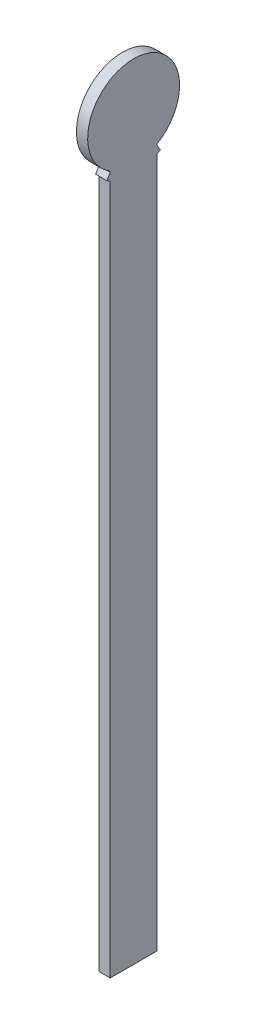
ISO-10303-21;
HEADER;
FILE_DESCRIPTION(('STEP AP214'),'2;1');
FILE_NAME('part.step','',(''),(''),'','','');
FILE_SCHEMA(('AUTOMOTIVE_DESIGN { 1 0 10303 214 1 1 1 1 }'));
ENDSEC;
DATA;
#1=APPLICATION_CONTEXT('core data for automotive mechanical design processes');
#2=APPLICATION_PROTOCOL_DEFINITION('international standard','automotive_design',2000,#1);
#3=PRODUCT_CONTEXT('',#1,'mechanical');
#4=PRODUCT('Part','Part','',(#3));
#5=PRODUCT_RELATED_PRODUCT_CATEGORY('part','',(#4));
#6=PRODUCT_DEFINITION_FORMATION('','',#4);
#7=PRODUCT_DEFINITION_CONTEXT('part definition',#1,'design');
#8=PRODUCT_DEFINITION('design','',#6,#7);
#9=PRODUCT_DEFINITION_SHAPE('','',#8);
#10=(LENGTH_UNIT() NAMED_UNIT(*) SI_UNIT(.MILLI.,.METRE.));
#11=(NAMED_UNIT(*) PLANE_ANGLE_UNIT() SI_UNIT($,.RADIAN.));
#12=(NAMED_UNIT(*) SI_UNIT($,.STERADIAN.) SOLID_ANGLE_UNIT());
#13=UNCERTAINTY_MEASURE_WITH_UNIT(LENGTH_MEASURE(1.E-05),#10,'distance_accuracy_value','');
#14=(GEOMETRIC_REPRESENTATION_CONTEXT(3) GLOBAL_UNCERTAINTY_ASSIGNED_CONTEXT((#13)) GLOBAL_UNIT_ASSIGNED_CONTEXT((#10,
#11,#12)) REPRESENTATION_CONTEXT('',''));
#15=CARTESIAN_POINT('',(0.,0.,0.));
#16=DIRECTION('',(0.,0.,1.));
#17=DIRECTION('',(1.,0.,0.));
#18=AXIS2_PLACEMENT_3D('',#15,#16,#17);
#19=CARTESIAN_POINT('',(3.,196.8,0.));
#20=DIRECTION('',(-1.,0.,0.));
#21=DIRECTION('',(0.,0.,1.));
#22=AXIS2_PLACEMENT_3D('',#19,#20,#21);
#23=CYLINDRICAL_SURFACE('',#22,24.5);
#24=CARTESIAN_POINT('',(-3.,196.8,0.));
#25=DIRECTION('',(1.,0.,0.));
#26=DIRECTION('',(0.,0.,-1.));
#27=AXIS2_PLACEMENT_3D('',#24,#25,#26);
#28=CIRCLE('',#27,24.5);
#29=CARTESIAN_POINT('',(-3.,175.728692494294,-12.4999999999994));
#30=VERTEX_POINT('',#29);
#31=CARTESIAN_POINT('',(-3.,175.728692494295,12.5000000000002));
#32=VERTEX_POINT('',#31);
#33=EDGE_CURVE('E148',#30,#32,#28,.T.);
#34=ORIENTED_EDGE('',*,*,#33,.T.);
#35=DIRECTION('',(-1.,0.,0.));
#36=VECTOR('',#35,1.);
#37=CARTESIAN_POINT('',(3.,175.728692494295,12.5000000000002));
#38=LINE('',#37,#36);
#39=CARTESIAN_POINT('',(3.,175.728692494295,12.5000000000002));
#40=VERTEX_POINT('',#39);
#41=EDGE_CURVE('E11',#40,#32,#38,.T.);
#42=ORIENTED_EDGE('',*,*,#41,.F.);
#43=CARTESIAN_POINT('',(3.,196.8,0.));
#44=DIRECTION('',(1.,0.,0.));
#45=DIRECTION('',(0.,0.,-1.));
#46=AXIS2_PLACEMENT_3D('',#43,#44,#45);
#47=CIRCLE('',#46,24.5);
#48=CARTESIAN_POINT('',(3.,175.728692494294,-12.4999999999994));
#49=VERTEX_POINT('',#48);
#50=EDGE_CURVE('E168',#49,#40,#47,.T.);
#51=ORIENTED_EDGE('',*,*,#50,.F.);
#52=DIRECTION('',(-1.,0.,0.));
#53=VECTOR('',#52,1.);
#54=CARTESIAN_POINT('',(3.,175.728692494294,-12.4999999999994));
#55=LINE('',#54,#53);
#56=EDGE_CURVE('E55',#49,#30,#55,.T.);
#57=ORIENTED_EDGE('',*,*,#56,.T.);
#58=EDGE_LOOP('',(#34,#42,#51,#57));
#59=FACE_BOUND('',#58,.T.);
#60=ADVANCED_FACE('F39',(#59),#23,.T.);
#61=CARTESIAN_POINT('',(3.,5.06683815275196E-13,12.5000000000074));
#62=DIRECTION('',(0.,0.,-1.));
#63=DIRECTION('',(0.,1.,0.));
#64=AXIS2_PLACEMENT_3D('',#61,#62,#63);
#65=PLANE('',#64);
#66=DIRECTION('',(0.,-1.,0.));
#67=VECTOR('',#66,1.);
#68=CARTESIAN_POINT('',(-3.,5.06683815275196E-13,12.5000000000074));
#69=LINE('',#68,#67);
#70=CARTESIAN_POINT('',(-3.,175.14936490539,12.5000000000003));
#71=VERTEX_POINT('',#70);
#72=EDGE_CURVE('E150',#32,#71,#69,.T.);
#73=ORIENTED_EDGE('',*,*,#72,.T.);
#74=DIRECTION('',(-1.,0.,0.));
#75=VECTOR('',#74,1.);
#76=CARTESIAN_POINT('',(3.,175.14936490539,12.5000000000003));
#77=LINE('',#76,#75);
#78=CARTESIAN_POINT('',(3.,175.14936490539,12.5000000000003));
#79=VERTEX_POINT('',#78);
#80=EDGE_CURVE('E47',#79,#71,#77,.T.);
#81=ORIENTED_EDGE('',*,*,#80,.F.);
#82=DIRECTION('',(0.,-1.,0.));
#83=VECTOR('',#82,1.);
#84=CARTESIAN_POINT('',(3.,5.06683815275196E-13,12.5000000000074));
#85=LINE('',#84,#83);
#86=EDGE_CURVE('E99',#40,#79,#85,.T.);
#87=ORIENTED_EDGE('',*,*,#86,.F.);
#88=ORIENTED_EDGE('',*,*,#41,.T.);
#89=EDGE_LOOP('',(#73,#81,#87,#88));
#90=FACE_BOUND('',#89,.T.);
#91=ADVANCED_FACE('F214',(#90),#65,.F.);
#92=CARTESIAN_POINT('',(3.,49.2000000000014,85.21689973239));
#93=DIRECTION('',(0.,-0.500000000000005,-0.866025403784436));
#94=DIRECTION('',(0.,0.866025403784436,-0.500000000000005));
#95=AXIS2_PLACEMENT_3D('',#92,#93,#94);
#96=PLANE('',#95);
#97=DIRECTION('',(0.,-0.866025403784436,0.500000000000005));
#98=VECTOR('',#97,1.);
#99=CARTESIAN_POINT('',(-3.,49.2000000000014,85.21689973239));
#100=LINE('',#99,#98);
#101=CARTESIAN_POINT('',(-3.,172.118275992144,14.2500000000009));
#102=VERTEX_POINT('',#101);
#103=EDGE_CURVE('E152',#71,#102,#100,.T.);
#104=ORIENTED_EDGE('',*,*,#103,.T.);
#105=DIRECTION('',(-1.,0.,0.));
#106=VECTOR('',#105,1.);
#107=CARTESIAN_POINT('',(3.,172.118275992144,14.2500000000009));
#108=LINE('',#107,#106);
#109=CARTESIAN_POINT('',(3.,172.118275992144,14.2500000000009));
#110=VERTEX_POINT('',#109);
#111=EDGE_CURVE('E181',#110,#102,#108,.T.);
#112=ORIENTED_EDGE('',*,*,#111,.F.);
#113=DIRECTION('',(0.,-0.866025403784436,0.500000000000005));
#114=VECTOR('',#113,1.);
#115=CARTESIAN_POINT('',(3.,49.2000000000014,85.21689973239));
#116=LINE('',#115,#114);
#117=EDGE_CURVE('E189',#79,#110,#116,.T.);
#118=ORIENTED_EDGE('',*,*,#117,.F.);
#119=ORIENTED_EDGE('',*,*,#80,.T.);
#120=EDGE_LOOP('',(#104,#112,#118,#119));
#121=FACE_BOUND('',#120,.T.);
#122=ADVANCED_FACE('F187',(#121),#96,.F.);
#123=CARTESIAN_POINT('',(3.,196.8,0.));
#124=DIRECTION('',(-1.,0.,0.));
#125=DIRECTION('',(0.,0.,1.));
#126=AXIS2_PLACEMENT_3D('',#123,#124,#125);
#127=CYLINDRICAL_SURFACE('',#126,28.5000000000001);
#128=CARTESIAN_POINT('',(-3.,196.8,0.));
#129=DIRECTION('',(1.,0.,0.));
#130=DIRECTION('',(0.,0.,-1.));
#131=AXIS2_PLACEMENT_3D('',#128,#129,#130);
#132=CIRCLE('',#131,28.5000000000001);
#133=CARTESIAN_POINT('',(-3.,171.187503050269,12.5000000000004));
#134=VERTEX_POINT('',#133);
#135=EDGE_CURVE('E154',#102,#134,#132,.T.);
#136=ORIENTED_EDGE('',*,*,#135,.T.);
#137=DIRECTION('',(-1.,0.,0.));
#138=VECTOR('',#137,1.);
#139=CARTESIAN_POINT('',(3.,171.187503050269,12.5000000000004));
#140=LINE('',#139,#138);
#141=CARTESIAN_POINT('',(3.,171.187503050269,12.5000000000004));
#142=VERTEX_POINT('',#141);
#143=EDGE_CURVE('E178',#142,#134,#140,.T.);
#144=ORIENTED_EDGE('',*,*,#143,.F.);
#145=CARTESIAN_POINT('',(3.,196.8,0.));
#146=DIRECTION('',(1.,0.,0.));
#147=DIRECTION('',(0.,0.,-1.));
#148=AXIS2_PLACEMENT_3D('',#145,#146,#147);
#149=CIRCLE('',#148,28.5000000000001);
#150=EDGE_CURVE('E206',#110,#142,#149,.T.);
#151=ORIENTED_EDGE('',*,*,#150,.F.);
#152=ORIENTED_EDGE('',*,*,#111,.T.);
#153=EDGE_LOOP('',(#136,#144,#151,#152));
#154=FACE_BOUND('',#153,.T.);
#155=ADVANCED_FACE('F197',(#154),#127,.T.);
#156=CARTESIAN_POINT('',(3.,5.06683815275196E-13,12.5000000000074));
#157=DIRECTION('',(0.,0.,-1.));
#158=DIRECTION('',(0.,1.,0.));
#159=AXIS2_PLACEMENT_3D('',#156,#157,#158);
#160=PLANE('',#159);
#161=DIRECTION('',(0.,-1.,0.));
#162=VECTOR('',#161,1.);
#163=CARTESIAN_POINT('',(-3.,5.06683815275196E-13,12.5000000000074));
#164=LINE('',#163,#162);
#165=CARTESIAN_POINT('',(-3.,-196.8,12.5));
#166=VERTEX_POINT('',#165);
#167=EDGE_CURVE('E156',#134,#166,#164,.T.);
#168=ORIENTED_EDGE('',*,*,#167,.T.);
#169=DIRECTION('',(-1.,0.,0.));
#170=VECTOR('',#169,1.);
#171=CARTESIAN_POINT('',(3.,-196.8,12.5));
#172=LINE('',#171,#170);
#173=CARTESIAN_POINT('',(3.,-196.8,12.5));
#174=VERTEX_POINT('',#173);
#175=EDGE_CURVE('E175',#174,#166,#172,.T.);
#176=ORIENTED_EDGE('',*,*,#175,.F.);
#177=DIRECTION('',(0.,-1.,0.));
#178=VECTOR('',#177,1.);
#179=CARTESIAN_POINT('',(3.,5.06683815275196E-13,12.5000000000074));
#180=LINE('',#179,#178);
#181=EDGE_CURVE('E203',#142,#174,#180,.T.);
#182=ORIENTED_EDGE('',*,*,#181,.F.);
#183=ORIENTED_EDGE('',*,*,#143,.T.);
#184=EDGE_LOOP('',(#168,#176,#182,#183));
#185=FACE_BOUND('',#184,.T.);
#186=ADVANCED_FACE('F201',(#185),#160,.F.);
#187=CARTESIAN_POINT('',(3.,-196.8,0.));
#188=DIRECTION('',(0.,1.,0.));
#189=DIRECTION('',(0.,0.,1.));
#190=AXIS2_PLACEMENT_3D('',#187,#188,#189);
#191=PLANE('',#190);
#192=DIRECTION('',(0.,0.,-1.));
#193=VECTOR('',#192,1.);
#194=CARTESIAN_POINT('',(-3.,-196.8,0.));
#195=LINE('',#194,#193);
#196=CARTESIAN_POINT('',(-3.,-196.8,-12.5));
#197=VERTEX_POINT('',#196);
#198=EDGE_CURVE('E158',#166,#197,#195,.T.);
#199=ORIENTED_EDGE('',*,*,#198,.T.);
#200=DIRECTION('',(-1.,0.,0.));
#201=VECTOR('',#200,1.);
#202=CARTESIAN_POINT('',(3.,-196.8,-12.5));
#203=LINE('',#202,#201);
#204=CARTESIAN_POINT('',(3.,-196.8,-12.5));
#205=VERTEX_POINT('',#204);
#206=EDGE_CURVE('E172',#205,#197,#203,.T.);
#207=ORIENTED_EDGE('',*,*,#206,.F.);
#208=DIRECTION('',(0.,0.,-1.));
#209=VECTOR('',#208,1.);
#210=CARTESIAN_POINT('',(3.,-196.8,0.));
#211=LINE('',#210,#209);
#212=EDGE_CURVE('E205',#174,#205,#211,.T.);
#213=ORIENTED_EDGE('',*,*,#212,.F.);
#214=ORIENTED_EDGE('',*,*,#175,.T.);
#215=EDGE_LOOP('',(#199,#207,#213,#214));
#216=FACE_BOUND('',#215,.T.);
#217=ADVANCED_FACE('F226',(#216),#191,.F.);
#218=CARTESIAN_POINT('',(3.,0.,-12.4999999999997));
#219=DIRECTION('',(0.,0.,1.));
#220=DIRECTION('',(0.,-1.,0.));
#221=AXIS2_PLACEMENT_3D('',#218,#219,#220);
#222=PLANE('',#221);
#223=DIRECTION('',(0.,1.,0.));
#224=VECTOR('',#223,1.);
#225=CARTESIAN_POINT('',(-3.,0.,-12.4999999999997));
#226=LINE('',#225,#224);
#227=CARTESIAN_POINT('',(-3.,171.187503050268,-12.4999999999994));
#228=VERTEX_POINT('',#227);
#229=EDGE_CURVE('E160',#197,#228,#226,.T.);
#230=ORIENTED_EDGE('',*,*,#229,.T.);
#231=DIRECTION('',(-1.,0.,0.));
#232=VECTOR('',#231,1.);
#233=CARTESIAN_POINT('',(3.,171.187503050268,-12.4999999999994));
#234=LINE('',#233,#232);
#235=CARTESIAN_POINT('',(3.,171.187503050268,-12.4999999999994));
#236=VERTEX_POINT('',#235);
#237=EDGE_CURVE('E140',#236,#228,#234,.T.);
#238=ORIENTED_EDGE('',*,*,#237,.F.);
#239=DIRECTION('',(0.,1.,0.));
#240=VECTOR('',#239,1.);
#241=CARTESIAN_POINT('',(3.,0.,-12.4999999999997));
#242=LINE('',#241,#240);
#243=EDGE_CURVE('E128',#205,#236,#242,.T.);
#244=ORIENTED_EDGE('',*,*,#243,.F.);
#245=ORIENTED_EDGE('',*,*,#206,.T.);
#246=EDGE_LOOP('',(#230,#238,#244,#245));
#247=FACE_BOUND('',#246,.T.);
#248=ADVANCED_FACE('F229',(#247),#222,.F.);
#249=CARTESIAN_POINT('',(3.,196.8,0.));
#250=DIRECTION('',(-1.,0.,0.));
#251=DIRECTION('',(0.,0.,1.));
#252=AXIS2_PLACEMENT_3D('',#249,#250,#251);
#253=CYLINDRICAL_SURFACE('',#252,28.5000000000001);
#254=CARTESIAN_POINT('',(-3.,196.8,0.));
#255=DIRECTION('',(1.,0.,0.));
#256=DIRECTION('',(0.,0.,-1.));
#257=AXIS2_PLACEMENT_3D('',#254,#255,#256);
#258=CIRCLE('',#257,28.5000000000001);
#259=CARTESIAN_POINT('',(-3.,172.118275992144,-14.2500000000007));
#260=VERTEX_POINT('',#259);
#261=EDGE_CURVE('E137',#228,#260,#258,.T.);
#262=ORIENTED_EDGE('',*,*,#261,.T.);
#263=DIRECTION('',(-1.,0.,0.));
#264=VECTOR('',#263,1.);
#265=CARTESIAN_POINT('',(3.,172.118275992144,-14.2500000000007));
#266=LINE('',#265,#264);
#267=CARTESIAN_POINT('',(3.,172.118275992144,-14.2500000000007));
#268=VERTEX_POINT('',#267);
#269=EDGE_CURVE('E134',#268,#260,#266,.T.);
#270=ORIENTED_EDGE('',*,*,#269,.F.);
#271=CARTESIAN_POINT('',(3.,196.8,0.));
#272=DIRECTION('',(1.,0.,0.));
#273=DIRECTION('',(0.,0.,-1.));
#274=AXIS2_PLACEMENT_3D('',#271,#272,#273);
#275=CIRCLE('',#274,28.5000000000001);
#276=EDGE_CURVE('E121',#236,#268,#275,.T.);
#277=ORIENTED_EDGE('',*,*,#276,.F.);
#278=ORIENTED_EDGE('',*,*,#237,.T.);
#279=EDGE_LOOP('',(#262,#270,#277,#278));
#280=FACE_BOUND('',#279,.T.);
#281=ADVANCED_FACE('F135',(#280),#253,.T.);
#282=CARTESIAN_POINT('',(3.,49.2000000000467,-85.2168997324113));
#283=DIRECTION('',(0.,0.500000000000257,-0.86602540378429));
#284=DIRECTION('',(0.,0.86602540378429,0.500000000000257));
#285=AXIS2_PLACEMENT_3D('',#282,#283,#284);
#286=PLANE('',#285);
#287=DIRECTION('',(0.,-0.86602540378429,-0.500000000000257));
#288=VECTOR('',#287,1.);
#289=CARTESIAN_POINT('',(-3.,49.2000000000467,-85.2168997324113));
#290=LINE('',#289,#288);
#291=CARTESIAN_POINT('',(-3.,175.149364905389,-12.4999999999994));
#292=VERTEX_POINT('',#291);
#293=EDGE_CURVE('E163',#292,#260,#290,.T.);
#294=ORIENTED_EDGE('',*,*,#293,.F.);
#295=DIRECTION('',(-1.,0.,0.));
#296=VECTOR('',#295,1.);
#297=CARTESIAN_POINT('',(3.,175.149364905389,-12.4999999999994));
#298=LINE('',#297,#296);
#299=CARTESIAN_POINT('',(3.,175.149364905389,-12.4999999999994));
#300=VERTEX_POINT('',#299);
#301=EDGE_CURVE('E87',#300,#292,#298,.T.);
#302=ORIENTED_EDGE('',*,*,#301,.F.);
#303=DIRECTION('',(0.,-0.86602540378429,-0.500000000000257));
#304=VECTOR('',#303,1.);
#305=CARTESIAN_POINT('',(3.,49.2000000000467,-85.2168997324113));
#306=LINE('',#305,#304);
#307=EDGE_CURVE('E126',#300,#268,#306,.T.);
#308=ORIENTED_EDGE('',*,*,#307,.T.);
#309=ORIENTED_EDGE('',*,*,#269,.T.);
#310=EDGE_LOOP('',(#294,#302,#308,#309));
#311=FACE_BOUND('',#310,.T.);
#312=ADVANCED_FACE('F142',(#311),#286,.T.);
#313=CARTESIAN_POINT('',(3.,0.,-12.4999999999994));
#314=DIRECTION('',(0.,0.,-1.));
#315=DIRECTION('',(-1.,0.,0.));
#316=AXIS2_PLACEMENT_3D('',#313,#314,#315);
#317=PLANE('',#316);
#318=DIRECTION('',(0.,-1.,0.));
#319=VECTOR('',#318,1.);
#320=CARTESIAN_POINT('',(-3.,0.,-12.4999999999994));
#321=LINE('',#320,#319);
#322=EDGE_CURVE('E165',#30,#292,#321,.T.);
#323=ORIENTED_EDGE('',*,*,#322,.F.);
#324=ORIENTED_EDGE('',*,*,#56,.F.);
#325=DIRECTION('',(0.,-1.,0.));
#326=VECTOR('',#325,1.);
#327=CARTESIAN_POINT('',(3.,0.,-12.4999999999994));
#328=LINE('',#327,#326);
#329=EDGE_CURVE('E143',#49,#300,#328,.T.);
#330=ORIENTED_EDGE('',*,*,#329,.T.);
#331=ORIENTED_EDGE('',*,*,#301,.T.);
#332=EDGE_LOOP('',(#323,#324,#330,#331));
#333=FACE_BOUND('',#332,.T.);
#334=ADVANCED_FACE('F238',(#333),#317,.T.);
#335=CARTESIAN_POINT('',(3.,0.,0.));
#336=DIRECTION('',(1.,0.,0.));
#337=DIRECTION('',(0.,0.,-1.));
#338=AXIS2_PLACEMENT_3D('',#335,#336,#337);
#339=PLANE('',#338);
#340=ORIENTED_EDGE('',*,*,#50,.T.);
#341=ORIENTED_EDGE('',*,*,#86,.T.);
#342=ORIENTED_EDGE('',*,*,#117,.T.);
#343=ORIENTED_EDGE('',*,*,#150,.T.);
#344=ORIENTED_EDGE('',*,*,#181,.T.);
#345=ORIENTED_EDGE('',*,*,#212,.T.);
#346=ORIENTED_EDGE('',*,*,#243,.T.);
#347=ORIENTED_EDGE('',*,*,#276,.T.);
#348=ORIENTED_EDGE('',*,*,#307,.F.);
#349=ORIENTED_EDGE('',*,*,#329,.F.);
#350=EDGE_LOOP('',(#340,#341,#342,#343,#344,#345,#346,#347,#348,#349));
#351=FACE_BOUND('',#350,.T.);
#352=ADVANCED_FACE('F123',(#351),#339,.T.);
#353=CARTESIAN_POINT('',(-3.,0.,0.));
#354=DIRECTION('',(1.,0.,0.));
#355=DIRECTION('',(0.,0.,-1.));
#356=AXIS2_PLACEMENT_3D('',#353,#354,#355);
#357=PLANE('',#356);
#358=ORIENTED_EDGE('',*,*,#33,.F.);
#359=ORIENTED_EDGE('',*,*,#322,.T.);
#360=ORIENTED_EDGE('',*,*,#293,.T.);
#361=ORIENTED_EDGE('',*,*,#261,.F.);
#362=ORIENTED_EDGE('',*,*,#229,.F.);
#363=ORIENTED_EDGE('',*,*,#198,.F.);
#364=ORIENTED_EDGE('',*,*,#167,.F.);
#365=ORIENTED_EDGE('',*,*,#135,.F.);
#366=ORIENTED_EDGE('',*,*,#103,.F.);
#367=ORIENTED_EDGE('',*,*,#72,.F.);
#368=EDGE_LOOP('',(#358,#359,#360,#361,#362,#363,#364,#365,#366,#367));
#369=FACE_BOUND('',#368,.T.);
#370=ADVANCED_FACE('F192',(#369),#357,.F.);
#371=CLOSED_SHELL('',(#60,#91,#122,#155,#186,#217,#248,#281,#312,#334,#352,#370));
#372=MANIFOLD_SOLID_BREP('B2',#371);
#373=ADVANCED_BREP_SHAPE_REPRESENTATION('',(#18,#372),#14);
#374=SHAPE_DEFINITION_REPRESENTATION(#9,#373);
ENDSEC;
END-ISO-10303-21;
